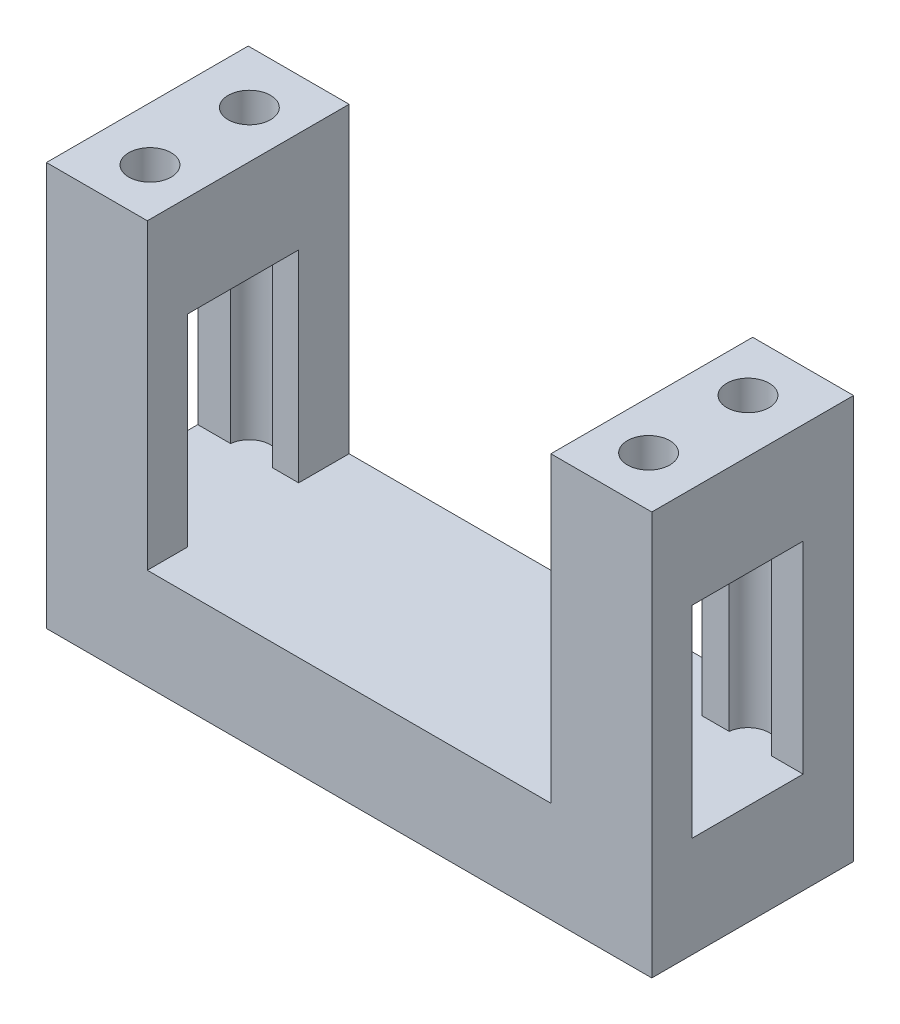
ISO-10303-21;
HEADER;
FILE_DESCRIPTION(('STEP AP214'),'2;1');
FILE_NAME('part.step','',(''),(''),'','','');
FILE_SCHEMA(('AUTOMOTIVE_DESIGN { 1 0 10303 214 1 1 1 1 }'));
ENDSEC;
DATA;
#1=APPLICATION_CONTEXT('core data for automotive mechanical design processes');
#2=APPLICATION_PROTOCOL_DEFINITION('international standard','automotive_design',2000,#1);
#3=PRODUCT_CONTEXT('',#1,'mechanical');
#4=PRODUCT('Part','Part','',(#3));
#5=PRODUCT_RELATED_PRODUCT_CATEGORY('part','',(#4));
#6=PRODUCT_DEFINITION_FORMATION('','',#4);
#7=PRODUCT_DEFINITION_CONTEXT('part definition',#1,'design');
#8=PRODUCT_DEFINITION('design','',#6,#7);
#9=PRODUCT_DEFINITION_SHAPE('','',#8);
#10=(LENGTH_UNIT() NAMED_UNIT(*) SI_UNIT(.MILLI.,.METRE.));
#11=(NAMED_UNIT(*) PLANE_ANGLE_UNIT() SI_UNIT($,.RADIAN.));
#12=(NAMED_UNIT(*) SI_UNIT($,.STERADIAN.) SOLID_ANGLE_UNIT());
#13=UNCERTAINTY_MEASURE_WITH_UNIT(LENGTH_MEASURE(1.E-05),#10,'distance_accuracy_value','');
#14=(GEOMETRIC_REPRESENTATION_CONTEXT(3) GLOBAL_UNCERTAINTY_ASSIGNED_CONTEXT((#13)) GLOBAL_UNIT_ASSIGNED_CONTEXT((#10,
#11,#12)) REPRESENTATION_CONTEXT('',''));
#15=CARTESIAN_POINT('',(0.,0.,0.));
#16=DIRECTION('',(0.,0.,1.));
#17=DIRECTION('',(1.,0.,0.));
#18=AXIS2_PLACEMENT_3D('',#15,#16,#17);
#19=CARTESIAN_POINT('',(0.,9.99999999999998,5.));
#20=DIRECTION('',(0.,0.,-1.));
#21=DIRECTION('',(-1.,0.,0.));
#22=AXIS2_PLACEMENT_3D('',#19,#20,#21);
#23=PLANE('',#22);
#24=DIRECTION('',(1.,0.,0.));
#25=VECTOR('',#24,1.);
#26=CARTESIAN_POINT('',(0.,9.99999999999998,5.));
#27=LINE('',#26,#25);
#28=CARTESIAN_POINT('',(50.,10.,5.));
#29=VERTEX_POINT('',#28);
#30=CARTESIAN_POINT('',(52.6732339819389,10.,5.));
#31=VERTEX_POINT('',#30);
#32=EDGE_CURVE('E230',#29,#31,#27,.T.);
#33=ORIENTED_EDGE('',*,*,#32,.T.);
#34=DIRECTION('',(0.,1.,0.));
#35=VECTOR('',#34,1.);
#36=CARTESIAN_POINT('',(52.6732339819389,4.06030303803297,5.));
#37=LINE('',#36,#35);
#38=CARTESIAN_POINT('',(52.6732339819389,30.,5.));
#39=VERTEX_POINT('',#38);
#40=EDGE_CURVE('E417',#31,#39,#37,.T.);
#41=ORIENTED_EDGE('',*,*,#40,.T.);
#42=DIRECTION('',(1.,0.,0.));
#43=VECTOR('',#42,1.);
#44=CARTESIAN_POINT('',(0.,30.,5.));
#45=LINE('',#44,#43);
#46=CARTESIAN_POINT('',(50.,30.,5.));
#47=VERTEX_POINT('',#46);
#48=EDGE_CURVE('E403',#47,#39,#45,.T.);
#49=ORIENTED_EDGE('',*,*,#48,.F.);
#50=DIRECTION('',(0.,1.,0.));
#51=VECTOR('',#50,1.);
#52=CARTESIAN_POINT('',(50.,10.,5.));
#53=LINE('',#52,#51);
#54=EDGE_CURVE('E279',#29,#47,#53,.T.);
#55=ORIENTED_EDGE('',*,*,#54,.F.);
#56=EDGE_LOOP('',(#33,#41,#49,#55));
#57=FACE_BOUND('',#56,.T.);
#58=ADVANCED_FACE('F39',(#57),#23,.F.);
#59=CARTESIAN_POINT('',(0.,9.99999999999998,16.));
#60=DIRECTION('',(0.,0.,1.));
#61=DIRECTION('',(1.,0.,0.));
#62=AXIS2_PLACEMENT_3D('',#59,#60,#61);
#63=PLANE('',#62);
#64=DIRECTION('',(1.,0.,0.));
#65=VECTOR('',#64,1.);
#66=CARTESIAN_POINT('',(0.,9.99999999999998,16.));
#67=LINE('',#66,#65);
#68=CARTESIAN_POINT('',(56.6464506331105,10.,16.));
#69=VERTEX_POINT('',#68);
#70=CARTESIAN_POINT('',(60.,10.,16.));
#71=VERTEX_POINT('',#70);
#72=EDGE_CURVE('E247',#69,#71,#67,.T.);
#73=ORIENTED_EDGE('',*,*,#72,.F.);
#74=DIRECTION('',(0.,1.,0.));
#75=VECTOR('',#74,1.);
#76=CARTESIAN_POINT('',(56.6464506331105,4.06030303803297,16.));
#77=LINE('',#76,#75);
#78=CARTESIAN_POINT('',(56.6464506331105,30.,16.));
#79=VERTEX_POINT('',#78);
#80=EDGE_CURVE('E48',#69,#79,#77,.T.);
#81=ORIENTED_EDGE('',*,*,#80,.T.);
#82=DIRECTION('',(1.,0.,0.));
#83=VECTOR('',#82,1.);
#84=CARTESIAN_POINT('',(0.,30.,16.));
#85=LINE('',#84,#83);
#86=CARTESIAN_POINT('',(60.,30.,16.));
#87=VERTEX_POINT('',#86);
#88=EDGE_CURVE('E383',#79,#87,#85,.T.);
#89=ORIENTED_EDGE('',*,*,#88,.T.);
#90=DIRECTION('',(0.,-1.,0.));
#91=VECTOR('',#90,1.);
#92=CARTESIAN_POINT('',(60.,10.,16.));
#93=LINE('',#92,#91);
#94=EDGE_CURVE('E432',#87,#71,#93,.T.);
#95=ORIENTED_EDGE('',*,*,#94,.T.);
#96=EDGE_LOOP('',(#73,#81,#89,#95));
#97=FACE_BOUND('',#96,.T.);
#98=ADVANCED_FACE('F381',(#97),#63,.F.);
#99=CARTESIAN_POINT('',(7.22415939711014,9.99999999999998,16.));
#100=VERTEX_POINT('',#99);
#101=CARTESIAN_POINT('',(9.99999999999999,10.,16.));
#102=VERTEX_POINT('',#101);
#103=EDGE_CURVE('E246',#100,#102,#67,.T.);
#104=ORIENTED_EDGE('',*,*,#103,.F.);
#105=DIRECTION('',(0.,1.,0.));
#106=VECTOR('',#105,1.);
#107=CARTESIAN_POINT('',(7.22415939711014,4.06030303803297,16.));
#108=LINE('',#107,#106);
#109=CARTESIAN_POINT('',(7.22415939711014,30.,16.));
#110=VERTEX_POINT('',#109);
#111=EDGE_CURVE('E371',#100,#110,#108,.T.);
#112=ORIENTED_EDGE('',*,*,#111,.T.);
#113=CARTESIAN_POINT('',(9.99999999999999,30.,16.));
#114=VERTEX_POINT('',#113);
#115=EDGE_CURVE('E398',#110,#114,#85,.T.);
#116=ORIENTED_EDGE('',*,*,#115,.T.);
#117=DIRECTION('',(0.,1.,0.));
#118=VECTOR('',#117,1.);
#119=CARTESIAN_POINT('',(9.99999999999999,10.,16.));
#120=LINE('',#119,#118);
#121=EDGE_CURVE('E271',#102,#114,#120,.T.);
#122=ORIENTED_EDGE('',*,*,#121,.F.);
#123=EDGE_LOOP('',(#104,#112,#116,#122));
#124=FACE_BOUND('',#123,.T.);
#125=ADVANCED_FACE('F547',(#124),#63,.F.);
#126=CARTESIAN_POINT('',(0.,9.99999999999998,5.));
#127=VERTEX_POINT('',#126);
#128=CARTESIAN_POINT('',(3.25094274593862,9.99999999999998,5.));
#129=VERTEX_POINT('',#128);
#130=EDGE_CURVE('E229',#127,#129,#27,.T.);
#131=ORIENTED_EDGE('',*,*,#130,.T.);
#132=DIRECTION('',(0.,1.,0.));
#133=VECTOR('',#132,1.);
#134=CARTESIAN_POINT('',(3.25094274593862,4.06030303803297,5.));
#135=LINE('',#134,#133);
#136=CARTESIAN_POINT('',(3.25094274593862,30.,5.));
#137=VERTEX_POINT('',#136);
#138=EDGE_CURVE('E205',#129,#137,#135,.T.);
#139=ORIENTED_EDGE('',*,*,#138,.T.);
#140=CARTESIAN_POINT('',(0.,30.,5.));
#141=VERTEX_POINT('',#140);
#142=EDGE_CURVE('E396',#141,#137,#45,.T.);
#143=ORIENTED_EDGE('',*,*,#142,.F.);
#144=DIRECTION('',(0.,1.,0.));
#145=VECTOR('',#144,1.);
#146=CARTESIAN_POINT('',(0.,9.99999999999998,5.));
#147=LINE('',#146,#145);
#148=EDGE_CURVE('E447',#127,#141,#147,.T.);
#149=ORIENTED_EDGE('',*,*,#148,.F.);
#150=EDGE_LOOP('',(#131,#139,#143,#149));
#151=FACE_BOUND('',#150,.T.);
#152=ADVANCED_FACE('F496',(#151),#23,.F.);
#153=CARTESIAN_POINT('',(0.,40.,20.));
#154=DIRECTION('',(0.,-1.,0.));
#155=DIRECTION('',(0.,0.,-1.));
#156=AXIS2_PLACEMENT_3D('',#153,#154,#155);
#157=PLANE('',#156);
#158=CARTESIAN_POINT('',(5.33885438199988,40.,15.0749999999999));
#159=DIRECTION('',(0.,1.,0.));
#160=DIRECTION('',(0.,0.,1.));
#161=AXIS2_PLACEMENT_3D('',#158,#159,#160);
#162=CIRCLE('',#161,2.10000000000001);
#163=CARTESIAN_POINT('',(5.33885438199988,40.,17.1749999999999));
#164=VERTEX_POINT('',#163);
#165=EDGE_CURVE('E480',#164,#164,#162,.T.);
#166=ORIENTED_EDGE('',*,*,#165,.F.);
#167=EDGE_LOOP('',(#166));
#168=FACE_BOUND('',#167,.T.);
#169=CARTESIAN_POINT('',(5.33885438199989,40.,5.225));
#170=DIRECTION('',(0.,1.,0.));
#171=DIRECTION('',(0.,0.,1.));
#172=AXIS2_PLACEMENT_3D('',#169,#170,#171);
#173=CIRCLE('',#172,2.10000000000001);
#174=CARTESIAN_POINT('',(5.33885438199989,40.,7.32500000000001));
#175=VERTEX_POINT('',#174);
#176=EDGE_CURVE('E211',#175,#175,#173,.T.);
#177=ORIENTED_EDGE('',*,*,#176,.F.);
#178=EDGE_LOOP('',(#177));
#179=FACE_BOUND('',#178,.T.);
#180=DIRECTION('',(-1.,0.,0.));
#181=VECTOR('',#180,1.);
#182=CARTESIAN_POINT('',(0.,40.,20.));
#183=LINE('',#182,#181);
#184=CARTESIAN_POINT('',(9.99999999999999,40.,20.));
#185=VERTEX_POINT('',#184);
#186=CARTESIAN_POINT('',(0.,40.,20.));
#187=VERTEX_POINT('',#186);
#188=EDGE_CURVE('E329',#185,#187,#183,.T.);
#189=ORIENTED_EDGE('',*,*,#188,.F.);
#190=DIRECTION('',(0.,0.,1.));
#191=VECTOR('',#190,1.);
#192=CARTESIAN_POINT('',(9.99999999999999,40.,0.));
#193=LINE('',#192,#191);
#194=CARTESIAN_POINT('',(9.99999999999999,40.,0.));
#195=VERTEX_POINT('',#194);
#196=EDGE_CURVE('E285',#195,#185,#193,.T.);
#197=ORIENTED_EDGE('',*,*,#196,.F.);
#198=DIRECTION('',(-1.,0.,0.));
#199=VECTOR('',#198,1.);
#200=CARTESIAN_POINT('',(0.,40.,0.));
#201=LINE('',#200,#199);
#202=CARTESIAN_POINT('',(0.,40.,0.));
#203=VERTEX_POINT('',#202);
#204=EDGE_CURVE('E344',#195,#203,#201,.T.);
#205=ORIENTED_EDGE('',*,*,#204,.T.);
#206=DIRECTION('',(0.,0.,-1.));
#207=VECTOR('',#206,1.);
#208=CARTESIAN_POINT('',(0.,40.,20.));
#209=LINE('',#208,#207);
#210=EDGE_CURVE('E334',#187,#203,#209,.T.);
#211=ORIENTED_EDGE('',*,*,#210,.F.);
#212=EDGE_LOOP('',(#189,#197,#205,#211));
#213=FACE_BOUND('',#212,.T.);
#214=ADVANCED_FACE('F493',(#168,#179,#213),#157,.F.);
#215=CARTESIAN_POINT('',(0.,0.,20.));
#216=DIRECTION('',(1.,0.,0.));
#217=DIRECTION('',(0.,1.,0.));
#218=AXIS2_PLACEMENT_3D('',#215,#216,#217);
#219=PLANE('',#218);
#220=DIRECTION('',(0.,0.,1.));
#221=VECTOR('',#220,1.);
#222=CARTESIAN_POINT('',(0.,30.,16.));
#223=LINE('',#222,#221);
#224=CARTESIAN_POINT('',(0.,30.,16.));
#225=VERTEX_POINT('',#224);
#226=EDGE_CURVE('E253',#141,#225,#223,.T.);
#227=ORIENTED_EDGE('',*,*,#226,.T.);
#228=DIRECTION('',(0.,-1.,0.));
#229=VECTOR('',#228,1.);
#230=CARTESIAN_POINT('',(0.,9.99999999999998,16.));
#231=LINE('',#230,#229);
#232=CARTESIAN_POINT('',(0.,9.99999999999998,16.));
#233=VERTEX_POINT('',#232);
#234=EDGE_CURVE('E434',#225,#233,#231,.T.);
#235=ORIENTED_EDGE('',*,*,#234,.T.);
#236=DIRECTION('',(0.,0.,-1.));
#237=VECTOR('',#236,1.);
#238=CARTESIAN_POINT('',(0.,9.99999999999998,16.));
#239=LINE('',#238,#237);
#240=EDGE_CURVE('E437',#233,#127,#239,.T.);
#241=ORIENTED_EDGE('',*,*,#240,.T.);
#242=ORIENTED_EDGE('',*,*,#148,.T.);
#243=EDGE_LOOP('',(#227,#235,#241,#242));
#244=FACE_BOUND('',#243,.T.);
#245=DIRECTION('',(0.,-1.,0.));
#246=VECTOR('',#245,1.);
#247=CARTESIAN_POINT('',(0.,0.,0.));
#248=LINE('',#247,#246);
#249=CARTESIAN_POINT('',(0.,0.,0.));
#250=VERTEX_POINT('',#249);
#251=EDGE_CURVE('E307',#203,#250,#248,.T.);
#252=ORIENTED_EDGE('',*,*,#251,.T.);
#253=DIRECTION('',(0.,0.,-1.));
#254=VECTOR('',#253,1.);
#255=CARTESIAN_POINT('',(0.,0.,20.));
#256=LINE('',#255,#254);
#257=CARTESIAN_POINT('',(0.,0.,20.));
#258=VERTEX_POINT('',#257);
#259=EDGE_CURVE('E359',#258,#250,#256,.T.);
#260=ORIENTED_EDGE('',*,*,#259,.F.);
#261=DIRECTION('',(0.,-1.,0.));
#262=VECTOR('',#261,1.);
#263=CARTESIAN_POINT('',(0.,0.,20.));
#264=LINE('',#263,#262);
#265=EDGE_CURVE('E318',#187,#258,#264,.T.);
#266=ORIENTED_EDGE('',*,*,#265,.F.);
#267=ORIENTED_EDGE('',*,*,#210,.T.);
#268=EDGE_LOOP('',(#252,#260,#266,#267));
#269=FACE_BOUND('',#268,.T.);
#270=ADVANCED_FACE('F41',(#244,#269),#219,.F.);
#271=CARTESIAN_POINT('',(0.,0.,20.));
#272=DIRECTION('',(0.,1.,0.));
#273=DIRECTION('',(0.,0.,1.));
#274=AXIS2_PLACEMENT_3D('',#271,#272,#273);
#275=PLANE('',#274);
#276=DIRECTION('',(1.,0.,0.));
#277=VECTOR('',#276,1.);
#278=CARTESIAN_POINT('',(0.,0.,0.));
#279=LINE('',#278,#277);
#280=CARTESIAN_POINT('',(60.,0.,0.));
#281=VERTEX_POINT('',#280);
#282=EDGE_CURVE('E338',#250,#281,#279,.T.);
#283=ORIENTED_EDGE('',*,*,#282,.T.);
#284=DIRECTION('',(0.,0.,-1.));
#285=VECTOR('',#284,1.);
#286=CARTESIAN_POINT('',(60.,0.,20.));
#287=LINE('',#286,#285);
#288=CARTESIAN_POINT('',(60.,0.,20.));
#289=VERTEX_POINT('',#288);
#290=EDGE_CURVE('E355',#289,#281,#287,.T.);
#291=ORIENTED_EDGE('',*,*,#290,.F.);
#292=DIRECTION('',(1.,0.,0.));
#293=VECTOR('',#292,1.);
#294=CARTESIAN_POINT('',(0.,0.,20.));
#295=LINE('',#294,#293);
#296=EDGE_CURVE('E322',#258,#289,#295,.T.);
#297=ORIENTED_EDGE('',*,*,#296,.F.);
#298=ORIENTED_EDGE('',*,*,#259,.T.);
#299=EDGE_LOOP('',(#283,#291,#297,#298));
#300=FACE_BOUND('',#299,.T.);
#301=ADVANCED_FACE('F580',(#300),#275,.F.);
#302=CARTESIAN_POINT('',(60.,0.,20.));
#303=DIRECTION('',(-1.,0.,0.));
#304=DIRECTION('',(0.,-1.,0.));
#305=AXIS2_PLACEMENT_3D('',#302,#303,#304);
#306=PLANE('',#305);
#307=DIRECTION('',(0.,0.,-1.));
#308=VECTOR('',#307,1.);
#309=CARTESIAN_POINT('',(60.,10.,16.));
#310=LINE('',#309,#308);
#311=CARTESIAN_POINT('',(60.,10.,5.));
#312=VERTEX_POINT('',#311);
#313=EDGE_CURVE('E428',#71,#312,#310,.T.);
#314=ORIENTED_EDGE('',*,*,#313,.F.);
#315=ORIENTED_EDGE('',*,*,#94,.F.);
#316=DIRECTION('',(0.,0.,1.));
#317=VECTOR('',#316,1.);
#318=CARTESIAN_POINT('',(60.,30.,16.));
#319=LINE('',#318,#317);
#320=CARTESIAN_POINT('',(60.,30.,5.));
#321=VERTEX_POINT('',#320);
#322=EDGE_CURVE('E392',#321,#87,#319,.T.);
#323=ORIENTED_EDGE('',*,*,#322,.F.);
#324=DIRECTION('',(0.,1.,0.));
#325=VECTOR('',#324,1.);
#326=CARTESIAN_POINT('',(60.,10.,5.));
#327=LINE('',#326,#325);
#328=EDGE_CURVE('E423',#312,#321,#327,.T.);
#329=ORIENTED_EDGE('',*,*,#328,.F.);
#330=EDGE_LOOP('',(#314,#315,#323,#329));
#331=FACE_BOUND('',#330,.T.);
#332=DIRECTION('',(0.,1.,0.));
#333=VECTOR('',#332,1.);
#334=CARTESIAN_POINT('',(60.,0.,0.));
#335=LINE('',#334,#333);
#336=CARTESIAN_POINT('',(60.,40.,0.));
#337=VERTEX_POINT('',#336);
#338=EDGE_CURVE('E341',#281,#337,#335,.T.);
#339=ORIENTED_EDGE('',*,*,#338,.T.);
#340=DIRECTION('',(0.,0.,-1.));
#341=VECTOR('',#340,1.);
#342=CARTESIAN_POINT('',(60.,40.,20.));
#343=LINE('',#342,#341);
#344=CARTESIAN_POINT('',(60.,40.,20.));
#345=VERTEX_POINT('',#344);
#346=EDGE_CURVE('E351',#345,#337,#343,.T.);
#347=ORIENTED_EDGE('',*,*,#346,.F.);
#348=DIRECTION('',(0.,1.,0.));
#349=VECTOR('',#348,1.);
#350=CARTESIAN_POINT('',(60.,0.,20.));
#351=LINE('',#350,#349);
#352=EDGE_CURVE('E326',#289,#345,#351,.T.);
#353=ORIENTED_EDGE('',*,*,#352,.F.);
#354=ORIENTED_EDGE('',*,*,#290,.T.);
#355=EDGE_LOOP('',(#339,#347,#353,#354));
#356=FACE_BOUND('',#355,.T.);
#357=ADVANCED_FACE('F430',(#331,#356),#306,.F.);
#358=CARTESIAN_POINT('',(54.7611456180002,40.,5.225));
#359=DIRECTION('',(0.,1.,0.));
#360=DIRECTION('',(0.,0.,1.));
#361=AXIS2_PLACEMENT_3D('',#358,#359,#360);
#362=CIRCLE('',#361,2.1);
#363=CARTESIAN_POINT('',(54.7611456180002,40.,7.325));
#364=VERTEX_POINT('',#363);
#365=EDGE_CURVE('E474',#364,#364,#362,.T.);
#366=ORIENTED_EDGE('',*,*,#365,.F.);
#367=EDGE_LOOP('',(#366));
#368=FACE_BOUND('',#367,.T.);
#369=CARTESIAN_POINT('',(54.7611456180002,40.,15.0749999999999));
#370=DIRECTION('',(0.,1.,0.));
#371=DIRECTION('',(0.,0.,1.));
#372=AXIS2_PLACEMENT_3D('',#369,#370,#371);
#373=CIRCLE('',#372,2.10000000000001);
#374=CARTESIAN_POINT('',(54.7611456180002,40.,17.175));
#375=VERTEX_POINT('',#374);
#376=EDGE_CURVE('E473',#375,#375,#373,.T.);
#377=ORIENTED_EDGE('',*,*,#376,.F.);
#378=EDGE_LOOP('',(#377));
#379=FACE_BOUND('',#378,.T.);
#380=CARTESIAN_POINT('',(50.,40.,0.));
#381=VERTEX_POINT('',#380);
#382=EDGE_CURVE('E323',#337,#381,#201,.T.);
#383=ORIENTED_EDGE('',*,*,#382,.T.);
#384=DIRECTION('',(0.,0.,-1.));
#385=VECTOR('',#384,1.);
#386=CARTESIAN_POINT('',(50.,40.,0.));
#387=LINE('',#386,#385);
#388=CARTESIAN_POINT('',(50.,40.,20.));
#389=VERTEX_POINT('',#388);
#390=EDGE_CURVE('E301',#389,#381,#387,.T.);
#391=ORIENTED_EDGE('',*,*,#390,.F.);
#392=EDGE_CURVE('E330',#345,#389,#183,.T.);
#393=ORIENTED_EDGE('',*,*,#392,.F.);
#394=ORIENTED_EDGE('',*,*,#346,.T.);
#395=EDGE_LOOP('',(#383,#391,#393,#394));
#396=FACE_BOUND('',#395,.T.);
#397=ADVANCED_FACE('F498',(#368,#379,#396),#157,.F.);
#398=CARTESIAN_POINT('',(0.,0.,20.));
#399=DIRECTION('',(0.,0.,-1.));
#400=DIRECTION('',(-1.,0.,0.));
#401=AXIS2_PLACEMENT_3D('',#398,#399,#400);
#402=PLANE('',#401);
#403=DIRECTION('',(1.,0.,0.));
#404=VECTOR('',#403,1.);
#405=CARTESIAN_POINT('',(9.99999999999999,10.,20.));
#406=LINE('',#405,#404);
#407=CARTESIAN_POINT('',(9.99999999999999,10.,20.));
#408=VERTEX_POINT('',#407);
#409=CARTESIAN_POINT('',(50.,10.,20.));
#410=VERTEX_POINT('',#409);
#411=EDGE_CURVE('E288',#408,#410,#406,.T.);
#412=ORIENTED_EDGE('',*,*,#411,.F.);
#413=DIRECTION('',(0.,1.,0.));
#414=VECTOR('',#413,1.);
#415=CARTESIAN_POINT('',(9.99999999999999,10.,20.));
#416=LINE('',#415,#414);
#417=EDGE_CURVE('E298',#408,#185,#416,.T.);
#418=ORIENTED_EDGE('',*,*,#417,.T.);
#419=ORIENTED_EDGE('',*,*,#188,.T.);
#420=ORIENTED_EDGE('',*,*,#265,.T.);
#421=ORIENTED_EDGE('',*,*,#296,.T.);
#422=ORIENTED_EDGE('',*,*,#352,.T.);
#423=ORIENTED_EDGE('',*,*,#392,.T.);
#424=DIRECTION('',(0.,1.,0.));
#425=VECTOR('',#424,1.);
#426=CARTESIAN_POINT('',(50.,10.,20.));
#427=LINE('',#426,#425);
#428=EDGE_CURVE('E312',#410,#389,#427,.T.);
#429=ORIENTED_EDGE('',*,*,#428,.F.);
#430=EDGE_LOOP('',(#412,#418,#419,#420,#421,#422,#423,#429));
#431=FACE_BOUND('',#430,.T.);
#432=ADVANCED_FACE('F519',(#431),#402,.F.);
#433=CARTESIAN_POINT('',(0.,0.,0.));
#434=DIRECTION('',(0.,0.,-1.));
#435=DIRECTION('',(-1.,0.,0.));
#436=AXIS2_PLACEMENT_3D('',#433,#434,#435);
#437=PLANE('',#436);
#438=DIRECTION('',(0.,1.,0.));
#439=VECTOR('',#438,1.);
#440=CARTESIAN_POINT('',(9.99999999999999,10.,0.));
#441=LINE('',#440,#439);
#442=CARTESIAN_POINT('',(9.99999999999999,10.,0.));
#443=VERTEX_POINT('',#442);
#444=EDGE_CURVE('E304',#443,#195,#441,.T.);
#445=ORIENTED_EDGE('',*,*,#444,.F.);
#446=DIRECTION('',(-1.,0.,0.));
#447=VECTOR('',#446,1.);
#448=CARTESIAN_POINT('',(9.99999999999999,10.,0.));
#449=LINE('',#448,#447);
#450=CARTESIAN_POINT('',(50.,10.,0.));
#451=VERTEX_POINT('',#450);
#452=EDGE_CURVE('E295',#451,#443,#449,.T.);
#453=ORIENTED_EDGE('',*,*,#452,.F.);
#454=DIRECTION('',(0.,1.,0.));
#455=VECTOR('',#454,1.);
#456=CARTESIAN_POINT('',(50.,10.,0.));
#457=LINE('',#456,#455);
#458=EDGE_CURVE('E308',#451,#381,#457,.T.);
#459=ORIENTED_EDGE('',*,*,#458,.T.);
#460=ORIENTED_EDGE('',*,*,#382,.F.);
#461=ORIENTED_EDGE('',*,*,#338,.F.);
#462=ORIENTED_EDGE('',*,*,#282,.F.);
#463=ORIENTED_EDGE('',*,*,#251,.F.);
#464=ORIENTED_EDGE('',*,*,#204,.F.);
#465=EDGE_LOOP('',(#445,#453,#459,#460,#461,#462,#463,#464));
#466=FACE_BOUND('',#465,.T.);
#467=ADVANCED_FACE('F528',(#466),#437,.T.);
#468=CARTESIAN_POINT('',(9.99999999999999,10.,0.));
#469=DIRECTION('',(-1.,0.,0.));
#470=DIRECTION('',(0.,0.,1.));
#471=AXIS2_PLACEMENT_3D('',#468,#469,#470);
#472=PLANE('',#471);
#473=DIRECTION('',(0.,0.,1.));
#474=VECTOR('',#473,1.);
#475=CARTESIAN_POINT('',(9.99999999999999,10.,0.));
#476=LINE('',#475,#474);
#477=EDGE_CURVE('E289',#102,#408,#476,.T.);
#478=ORIENTED_EDGE('',*,*,#477,.F.);
#479=ORIENTED_EDGE('',*,*,#121,.T.);
#480=DIRECTION('',(0.,0.,-1.));
#481=VECTOR('',#480,1.);
#482=CARTESIAN_POINT('',(9.99999999999999,30.,0.));
#483=LINE('',#482,#481);
#484=CARTESIAN_POINT('',(9.99999999999999,30.,5.));
#485=VERTEX_POINT('',#484);
#486=EDGE_CURVE('E277',#114,#485,#483,.T.);
#487=ORIENTED_EDGE('',*,*,#486,.T.);
#488=DIRECTION('',(0.,-1.,0.));
#489=VECTOR('',#488,1.);
#490=CARTESIAN_POINT('',(9.99999999999999,10.,5.));
#491=LINE('',#490,#489);
#492=CARTESIAN_POINT('',(9.99999999999999,9.99999999999998,5.));
#493=VERTEX_POINT('',#492);
#494=EDGE_CURVE('E272',#485,#493,#491,.T.);
#495=ORIENTED_EDGE('',*,*,#494,.T.);
#496=EDGE_CURVE('E227',#443,#493,#476,.T.);
#497=ORIENTED_EDGE('',*,*,#496,.F.);
#498=ORIENTED_EDGE('',*,*,#444,.T.);
#499=ORIENTED_EDGE('',*,*,#196,.T.);
#500=ORIENTED_EDGE('',*,*,#417,.F.);
#501=EDGE_LOOP('',(#478,#479,#487,#495,#497,#498,#499,#500));
#502=FACE_BOUND('',#501,.T.);
#503=ADVANCED_FACE('F518',(#502),#472,.F.);
#504=CARTESIAN_POINT('',(50.,10.,0.));
#505=DIRECTION('',(1.,0.,0.));
#506=DIRECTION('',(0.,0.,-1.));
#507=AXIS2_PLACEMENT_3D('',#504,#505,#506);
#508=PLANE('',#507);
#509=DIRECTION('',(0.,0.,1.));
#510=VECTOR('',#509,1.);
#511=CARTESIAN_POINT('',(50.,30.,0.));
#512=LINE('',#511,#510);
#513=CARTESIAN_POINT('',(50.,30.,16.));
#514=VERTEX_POINT('',#513);
#515=EDGE_CURVE('E221',#47,#514,#512,.T.);
#516=ORIENTED_EDGE('',*,*,#515,.T.);
#517=DIRECTION('',(0.,-1.,0.));
#518=VECTOR('',#517,1.);
#519=CARTESIAN_POINT('',(50.,10.,16.));
#520=LINE('',#519,#518);
#521=CARTESIAN_POINT('',(50.,10.,16.));
#522=VERTEX_POINT('',#521);
#523=EDGE_CURVE('E263',#514,#522,#520,.T.);
#524=ORIENTED_EDGE('',*,*,#523,.T.);
#525=DIRECTION('',(0.,0.,-1.));
#526=VECTOR('',#525,1.);
#527=CARTESIAN_POINT('',(50.,10.,0.));
#528=LINE('',#527,#526);
#529=EDGE_CURVE('E257',#410,#522,#528,.T.);
#530=ORIENTED_EDGE('',*,*,#529,.F.);
#531=ORIENTED_EDGE('',*,*,#428,.T.);
#532=ORIENTED_EDGE('',*,*,#390,.T.);
#533=ORIENTED_EDGE('',*,*,#458,.F.);
#534=EDGE_CURVE('E292',#29,#451,#528,.T.);
#535=ORIENTED_EDGE('',*,*,#534,.F.);
#536=ORIENTED_EDGE('',*,*,#54,.T.);
#537=EDGE_LOOP('',(#516,#524,#530,#531,#532,#533,#535,#536));
#538=FACE_BOUND('',#537,.T.);
#539=ADVANCED_FACE('F268',(#538),#508,.F.);
#540=CARTESIAN_POINT('',(0.,10.,0.));
#541=DIRECTION('',(0.,1.,0.));
#542=DIRECTION('',(0.,0.,1.));
#543=AXIS2_PLACEMENT_3D('',#540,#541,#542);
#544=PLANE('',#543);
#545=CARTESIAN_POINT('',(56.8490572540615,10.,5.));
#546=VERTEX_POINT('',#545);
#547=EDGE_CURVE('E232',#546,#312,#27,.T.);
#548=ORIENTED_EDGE('',*,*,#547,.F.);
#549=CARTESIAN_POINT('',(54.7611456180002,10.,5.225));
#550=DIRECTION('',(0.,1.,0.));
#551=DIRECTION('',(0.,0.,1.));
#552=AXIS2_PLACEMENT_3D('',#549,#550,#551);
#553=CIRCLE('',#552,2.1);
#554=EDGE_CURVE('E470',#31,#546,#553,.F.);
#555=ORIENTED_EDGE('',*,*,#554,.F.);
#556=ORIENTED_EDGE('',*,*,#32,.F.);
#557=ORIENTED_EDGE('',*,*,#534,.T.);
#558=ORIENTED_EDGE('',*,*,#452,.T.);
#559=ORIENTED_EDGE('',*,*,#496,.T.);
#560=CARTESIAN_POINT('',(7.42676601806116,10.,5.));
#561=VERTEX_POINT('',#560);
#562=EDGE_CURVE('E217',#561,#493,#27,.T.);
#563=ORIENTED_EDGE('',*,*,#562,.F.);
#564=CARTESIAN_POINT('',(5.33885438199989,10.,5.225));
#565=DIRECTION('',(0.,1.,0.));
#566=DIRECTION('',(0.,0.,1.));
#567=AXIS2_PLACEMENT_3D('',#564,#565,#566);
#568=CIRCLE('',#567,2.10000000000001);
#569=EDGE_CURVE('E199',#129,#561,#568,.F.);
#570=ORIENTED_EDGE('',*,*,#569,.F.);
#571=ORIENTED_EDGE('',*,*,#130,.F.);
#572=ORIENTED_EDGE('',*,*,#240,.F.);
#573=CARTESIAN_POINT('',(3.45354936688962,10.,16.));
#574=VERTEX_POINT('',#573);
#575=EDGE_CURVE('E240',#233,#574,#67,.T.);
#576=ORIENTED_EDGE('',*,*,#575,.T.);
#577=CARTESIAN_POINT('',(5.33885438199988,10.,15.0749999999999));
#578=DIRECTION('',(0.,1.,0.));
#579=DIRECTION('',(0.,0.,1.));
#580=AXIS2_PLACEMENT_3D('',#577,#578,#579);
#581=CIRCLE('',#580,2.10000000000001);
#582=EDGE_CURVE('E469',#100,#574,#581,.F.);
#583=ORIENTED_EDGE('',*,*,#582,.F.);
#584=ORIENTED_EDGE('',*,*,#103,.T.);
#585=ORIENTED_EDGE('',*,*,#477,.T.);
#586=ORIENTED_EDGE('',*,*,#411,.T.);
#587=ORIENTED_EDGE('',*,*,#529,.T.);
#588=CARTESIAN_POINT('',(52.8758406028899,10.,16.));
#589=VERTEX_POINT('',#588);
#590=EDGE_CURVE('E248',#522,#589,#67,.T.);
#591=ORIENTED_EDGE('',*,*,#590,.T.);
#592=CARTESIAN_POINT('',(54.7611456180002,10.,15.0749999999999));
#593=DIRECTION('',(0.,1.,0.));
#594=DIRECTION('',(0.,0.,1.));
#595=AXIS2_PLACEMENT_3D('',#592,#593,#594);
#596=CIRCLE('',#595,2.10000000000001);
#597=EDGE_CURVE('E62',#69,#589,#596,.F.);
#598=ORIENTED_EDGE('',*,*,#597,.F.);
#599=ORIENTED_EDGE('',*,*,#72,.T.);
#600=ORIENTED_EDGE('',*,*,#313,.T.);
#601=EDGE_LOOP('',(#548,#555,#556,#557,#558,#559,#563,#570,#571,#572,#576,#583,#584,#585,#586,
#587,#591,#598,#599,#600));
#602=FACE_BOUND('',#601,.T.);
#603=ADVANCED_FACE('F225',(#602),#544,.T.);
#604=CARTESIAN_POINT('',(56.8490572540615,30.,5.));
#605=VERTEX_POINT('',#604);
#606=EDGE_CURVE('E235',#605,#321,#45,.T.);
#607=ORIENTED_EDGE('',*,*,#606,.F.);
#608=DIRECTION('',(0.,1.,0.));
#609=VECTOR('',#608,1.);
#610=CARTESIAN_POINT('',(56.8490572540615,4.06030303803297,5.));
#611=LINE('',#610,#609);
#612=EDGE_CURVE('E55',#605,#546,#611,.F.);
#613=ORIENTED_EDGE('',*,*,#612,.T.);
#614=ORIENTED_EDGE('',*,*,#547,.T.);
#615=ORIENTED_EDGE('',*,*,#328,.T.);
#616=EDGE_LOOP('',(#607,#613,#614,#615));
#617=FACE_BOUND('',#616,.T.);
#618=ADVANCED_FACE('F424',(#617),#23,.F.);
#619=CARTESIAN_POINT('',(0.,30.,16.));
#620=DIRECTION('',(0.,1.,0.));
#621=DIRECTION('',(-1.,0.,0.));
#622=AXIS2_PLACEMENT_3D('',#619,#620,#621);
#623=PLANE('',#622);
#624=ORIENTED_EDGE('',*,*,#48,.T.);
#625=CARTESIAN_POINT('',(54.7611456180002,30.,5.225));
#626=DIRECTION('',(0.,1.,0.));
#627=DIRECTION('',(-1.,0.,0.));
#628=AXIS2_PLACEMENT_3D('',#625,#626,#627);
#629=CIRCLE('',#628,2.1);
#630=EDGE_CURVE('E11',#39,#605,#629,.T.);
#631=ORIENTED_EDGE('',*,*,#630,.T.);
#632=ORIENTED_EDGE('',*,*,#606,.T.);
#633=ORIENTED_EDGE('',*,*,#322,.T.);
#634=ORIENTED_EDGE('',*,*,#88,.F.);
#635=CARTESIAN_POINT('',(54.7611456180002,30.,15.0749999999999));
#636=DIRECTION('',(0.,1.,0.));
#637=DIRECTION('',(-1.,0.,0.));
#638=AXIS2_PLACEMENT_3D('',#635,#636,#637);
#639=CIRCLE('',#638,2.10000000000001);
#640=CARTESIAN_POINT('',(52.8758406028899,30.,16.));
#641=VERTEX_POINT('',#640);
#642=EDGE_CURVE('E390',#79,#641,#639,.T.);
#643=ORIENTED_EDGE('',*,*,#642,.T.);
#644=EDGE_CURVE('E395',#514,#641,#85,.T.);
#645=ORIENTED_EDGE('',*,*,#644,.F.);
#646=ORIENTED_EDGE('',*,*,#515,.F.);
#647=EDGE_LOOP('',(#624,#631,#632,#633,#634,#643,#645,#646));
#648=FACE_BOUND('',#647,.T.);
#649=ADVANCED_FACE('F389',(#648),#623,.F.);
#650=ORIENTED_EDGE('',*,*,#644,.T.);
#651=DIRECTION('',(0.,1.,0.));
#652=VECTOR('',#651,1.);
#653=CARTESIAN_POINT('',(52.8758406028899,4.06030303803297,16.));
#654=LINE('',#653,#652);
#655=EDGE_CURVE('E265',#641,#589,#654,.F.);
#656=ORIENTED_EDGE('',*,*,#655,.T.);
#657=ORIENTED_EDGE('',*,*,#590,.F.);
#658=ORIENTED_EDGE('',*,*,#523,.F.);
#659=EDGE_LOOP('',(#650,#656,#657,#658));
#660=FACE_BOUND('',#659,.T.);
#661=ADVANCED_FACE('F262',(#660),#63,.F.);
#662=ORIENTED_EDGE('',*,*,#115,.F.);
#663=CARTESIAN_POINT('',(5.33885438199988,30.,15.0749999999999));
#664=DIRECTION('',(0.,1.,0.));
#665=DIRECTION('',(-1.,0.,0.));
#666=AXIS2_PLACEMENT_3D('',#663,#664,#665);
#667=CIRCLE('',#666,2.10000000000001);
#668=CARTESIAN_POINT('',(3.45354936688962,30.,16.));
#669=VERTEX_POINT('',#668);
#670=EDGE_CURVE('E460',#110,#669,#667,.T.);
#671=ORIENTED_EDGE('',*,*,#670,.T.);
#672=EDGE_CURVE('E399',#225,#669,#85,.T.);
#673=ORIENTED_EDGE('',*,*,#672,.F.);
#674=ORIENTED_EDGE('',*,*,#226,.F.);
#675=ORIENTED_EDGE('',*,*,#142,.T.);
#676=CARTESIAN_POINT('',(5.33885438199989,30.,5.225));
#677=DIRECTION('',(0.,1.,0.));
#678=DIRECTION('',(-1.,0.,0.));
#679=AXIS2_PLACEMENT_3D('',#676,#677,#678);
#680=CIRCLE('',#679,2.10000000000001);
#681=CARTESIAN_POINT('',(7.42676601806116,30.,5.));
#682=VERTEX_POINT('',#681);
#683=EDGE_CURVE('E210',#137,#682,#680,.T.);
#684=ORIENTED_EDGE('',*,*,#683,.T.);
#685=EDGE_CURVE('E219',#682,#485,#45,.T.);
#686=ORIENTED_EDGE('',*,*,#685,.T.);
#687=ORIENTED_EDGE('',*,*,#486,.F.);
#688=EDGE_LOOP('',(#662,#671,#673,#674,#675,#684,#686,#687));
#689=FACE_BOUND('',#688,.T.);
#690=ADVANCED_FACE('F559',(#689),#623,.F.);
#691=ORIENTED_EDGE('',*,*,#672,.T.);
#692=DIRECTION('',(0.,1.,0.));
#693=VECTOR('',#692,1.);
#694=CARTESIAN_POINT('',(3.45354936688962,4.06030303803297,16.));
#695=LINE('',#694,#693);
#696=EDGE_CURVE('E367',#669,#574,#695,.F.);
#697=ORIENTED_EDGE('',*,*,#696,.T.);
#698=ORIENTED_EDGE('',*,*,#575,.F.);
#699=ORIENTED_EDGE('',*,*,#234,.F.);
#700=EDGE_LOOP('',(#691,#697,#698,#699));
#701=FACE_BOUND('',#700,.T.);
#702=ADVANCED_FACE('F549',(#701),#63,.F.);
#703=ORIENTED_EDGE('',*,*,#685,.F.);
#704=DIRECTION('',(0.,1.,0.));
#705=VECTOR('',#704,1.);
#706=CARTESIAN_POINT('',(7.42676601806116,4.06030303803297,5.));
#707=LINE('',#706,#705);
#708=EDGE_CURVE('E202',#682,#561,#707,.F.);
#709=ORIENTED_EDGE('',*,*,#708,.T.);
#710=ORIENTED_EDGE('',*,*,#562,.T.);
#711=ORIENTED_EDGE('',*,*,#494,.F.);
#712=EDGE_LOOP('',(#703,#709,#710,#711));
#713=FACE_BOUND('',#712,.T.);
#714=ADVANCED_FACE('F215',(#713),#23,.F.);
#715=CARTESIAN_POINT('',(5.33885438199989,4.06030303803297,5.225));
#716=DIRECTION('',(0.,1.,0.));
#717=DIRECTION('',(0.,0.,1.));
#718=AXIS2_PLACEMENT_3D('',#715,#716,#717);
#719=CYLINDRICAL_SURFACE('',#718,2.10000000000001);
#720=ORIENTED_EDGE('',*,*,#176,.T.);
#721=EDGE_LOOP('',(#720));
#722=FACE_BOUND('',#721,.T.);
#723=ORIENTED_EDGE('',*,*,#569,.T.);
#724=ORIENTED_EDGE('',*,*,#708,.F.);
#725=ORIENTED_EDGE('',*,*,#683,.F.);
#726=ORIENTED_EDGE('',*,*,#138,.F.);
#727=EDGE_LOOP('',(#723,#724,#725,#726));
#728=FACE_BOUND('',#727,.T.);
#729=ADVANCED_FACE('F201',(#722,#728),#719,.F.);
#730=CARTESIAN_POINT('',(5.33885438199988,4.06030303803297,15.0749999999999));
#731=DIRECTION('',(0.,1.,0.));
#732=DIRECTION('',(0.,0.,1.));
#733=AXIS2_PLACEMENT_3D('',#730,#731,#732);
#734=CYLINDRICAL_SURFACE('',#733,2.10000000000001);
#735=ORIENTED_EDGE('',*,*,#165,.T.);
#736=EDGE_LOOP('',(#735));
#737=FACE_BOUND('',#736,.T.);
#738=ORIENTED_EDGE('',*,*,#582,.T.);
#739=ORIENTED_EDGE('',*,*,#696,.F.);
#740=ORIENTED_EDGE('',*,*,#670,.F.);
#741=ORIENTED_EDGE('',*,*,#111,.F.);
#742=EDGE_LOOP('',(#738,#739,#740,#741));
#743=FACE_BOUND('',#742,.T.);
#744=ADVANCED_FACE('F490',(#737,#743),#734,.F.);
#745=CARTESIAN_POINT('',(54.7611456180002,4.06030303803297,15.0749999999999));
#746=DIRECTION('',(0.,1.,0.));
#747=DIRECTION('',(0.,0.,1.));
#748=AXIS2_PLACEMENT_3D('',#745,#746,#747);
#749=CYLINDRICAL_SURFACE('',#748,2.10000000000001);
#750=ORIENTED_EDGE('',*,*,#376,.T.);
#751=EDGE_LOOP('',(#750));
#752=FACE_BOUND('',#751,.T.);
#753=ORIENTED_EDGE('',*,*,#597,.T.);
#754=ORIENTED_EDGE('',*,*,#655,.F.);
#755=ORIENTED_EDGE('',*,*,#642,.F.);
#756=ORIENTED_EDGE('',*,*,#80,.F.);
#757=EDGE_LOOP('',(#753,#754,#755,#756));
#758=FACE_BOUND('',#757,.T.);
#759=ADVANCED_FACE('F533',(#752,#758),#749,.F.);
#760=CARTESIAN_POINT('',(54.7611456180002,4.06030303803297,5.225));
#761=DIRECTION('',(0.,1.,0.));
#762=DIRECTION('',(0.,0.,1.));
#763=AXIS2_PLACEMENT_3D('',#760,#761,#762);
#764=CYLINDRICAL_SURFACE('',#763,2.1);
#765=ORIENTED_EDGE('',*,*,#365,.T.);
#766=EDGE_LOOP('',(#765));
#767=FACE_BOUND('',#766,.T.);
#768=ORIENTED_EDGE('',*,*,#554,.T.);
#769=ORIENTED_EDGE('',*,*,#612,.F.);
#770=ORIENTED_EDGE('',*,*,#630,.F.);
#771=ORIENTED_EDGE('',*,*,#40,.F.);
#772=EDGE_LOOP('',(#768,#769,#770,#771));
#773=FACE_BOUND('',#772,.T.);
#774=ADVANCED_FACE('F531',(#767,#773),#764,.F.);
#775=CLOSED_SHELL('',(#58,#98,#125,#152,#214,#270,#301,#357,#397,#432,#467,#503,#539,#603,#618,
#649,#661,#690,#702,#714,#729,#744,#759,#774));
#776=MANIFOLD_SOLID_BREP('B2',#775);
#777=ADVANCED_BREP_SHAPE_REPRESENTATION('',(#18,#776),#14);
#778=SHAPE_DEFINITION_REPRESENTATION(#9,#777);
ENDSEC;
END-ISO-10303-21;
